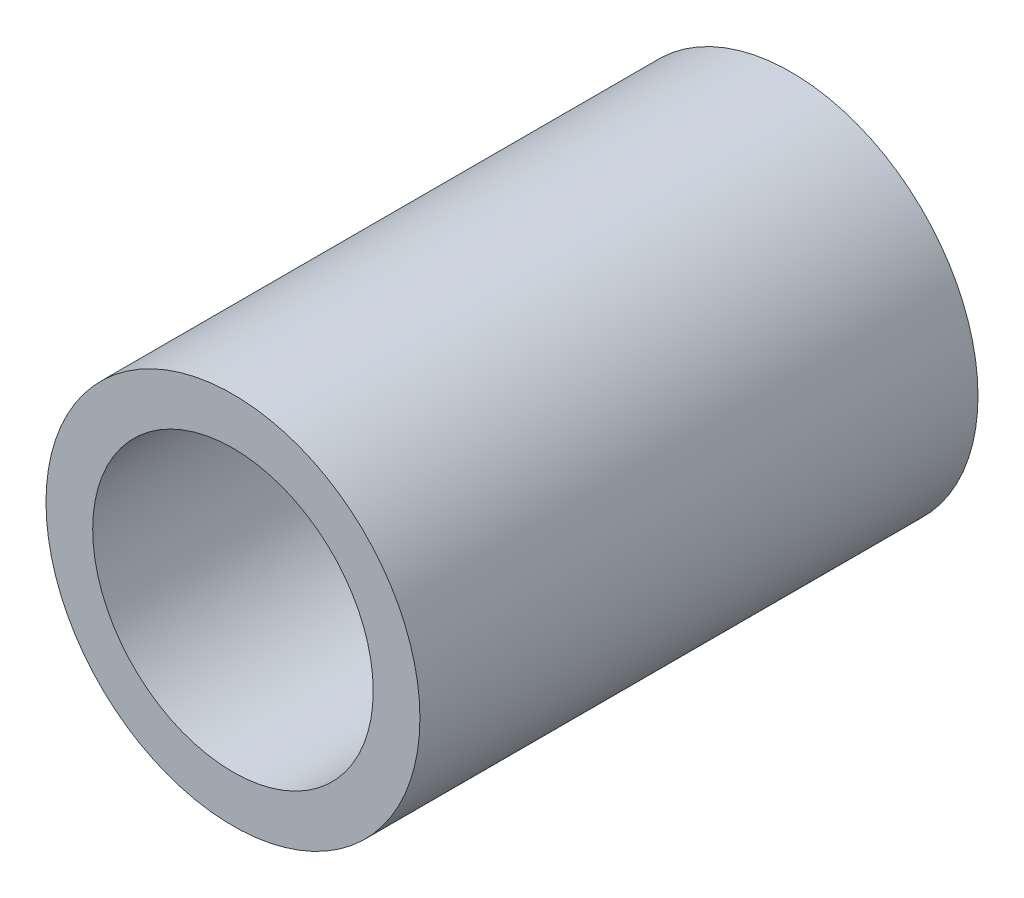
ISO-10303-21;
HEADER;
FILE_DESCRIPTION(('STEP AP214'),'2;1');
FILE_NAME('part.step','',(''),(''),'','','');
FILE_SCHEMA(('AUTOMOTIVE_DESIGN { 1 0 10303 214 1 1 1 1 }'));
ENDSEC;
DATA;
#1=APPLICATION_CONTEXT('core data for automotive mechanical design processes');
#2=APPLICATION_PROTOCOL_DEFINITION('international standard','automotive_design',2000,#1);
#3=PRODUCT_CONTEXT('',#1,'mechanical');
#4=PRODUCT('Part','Part','',(#3));
#5=PRODUCT_RELATED_PRODUCT_CATEGORY('part','',(#4));
#6=PRODUCT_DEFINITION_FORMATION('','',#4);
#7=PRODUCT_DEFINITION_CONTEXT('part definition',#1,'design');
#8=PRODUCT_DEFINITION('design','',#6,#7);
#9=PRODUCT_DEFINITION_SHAPE('','',#8);
#10=(LENGTH_UNIT() NAMED_UNIT(*) SI_UNIT(.MILLI.,.METRE.));
#11=(NAMED_UNIT(*) PLANE_ANGLE_UNIT() SI_UNIT($,.RADIAN.));
#12=(NAMED_UNIT(*) SI_UNIT($,.STERADIAN.) SOLID_ANGLE_UNIT());
#13=UNCERTAINTY_MEASURE_WITH_UNIT(LENGTH_MEASURE(1.E-05),#10,'distance_accuracy_value','');
#14=(GEOMETRIC_REPRESENTATION_CONTEXT(3) GLOBAL_UNCERTAINTY_ASSIGNED_CONTEXT((#13)) GLOBAL_UNIT_ASSIGNED_CONTEXT((#10,
#11,#12)) REPRESENTATION_CONTEXT('',''));
#15=CARTESIAN_POINT('',(0.,0.,0.));
#16=DIRECTION('',(0.,0.,1.));
#17=DIRECTION('',(1.,0.,0.));
#18=AXIS2_PLACEMENT_3D('',#15,#16,#17);
#19=CARTESIAN_POINT('',(0.,0.,-9.525));
#20=DIRECTION('',(0.,0.,1.));
#21=DIRECTION('',(1.,0.,0.));
#22=AXIS2_PLACEMENT_3D('',#19,#20,#21);
#23=CYLINDRICAL_SURFACE('',#22,4.7879);
#24=CARTESIAN_POINT('',(0.,0.,9.525));
#25=DIRECTION('',(0.,0.,1.));
#26=DIRECTION('',(1.,0.,0.));
#27=AXIS2_PLACEMENT_3D('',#24,#25,#26);
#28=CIRCLE('',#27,4.7879);
#29=CARTESIAN_POINT('',(4.7879,0.,9.525));
#30=VERTEX_POINT('',#29);
#31=EDGE_CURVE('E18',#30,#30,#28,.F.);
#32=ORIENTED_EDGE('',*,*,#31,.F.);
#33=EDGE_LOOP('',(#32));
#34=FACE_BOUND('',#33,.T.);
#35=CARTESIAN_POINT('',(0.,0.,-9.525));
#36=DIRECTION('',(0.,0.,1.));
#37=DIRECTION('',(1.,0.,0.));
#38=AXIS2_PLACEMENT_3D('',#35,#36,#37);
#39=CIRCLE('',#38,4.7879);
#40=CARTESIAN_POINT('',(4.7879,0.,-9.525));
#41=VERTEX_POINT('',#40);
#42=EDGE_CURVE('E27',#41,#41,#39,.T.);
#43=ORIENTED_EDGE('',*,*,#42,.F.);
#44=EDGE_LOOP('',(#43));
#45=FACE_BOUND('',#44,.T.);
#46=ADVANCED_FACE('F15',(#34,#45),#23,.F.);
#47=CARTESIAN_POINT('',(0.,6.38175,9.525));
#48=DIRECTION('',(0.,0.,1.));
#49=DIRECTION('',(1.,0.,0.));
#50=AXIS2_PLACEMENT_3D('',#47,#48,#49);
#51=PLANE('',#50);
#52=CARTESIAN_POINT('',(0.,0.,9.525));
#53=DIRECTION('',(0.,0.,1.));
#54=DIRECTION('',(1.,0.,0.));
#55=AXIS2_PLACEMENT_3D('',#52,#53,#54);
#56=CIRCLE('',#55,6.38175);
#57=CARTESIAN_POINT('',(6.38175,0.,9.525));
#58=VERTEX_POINT('',#57);
#59=EDGE_CURVE('E22',#58,#58,#56,.F.);
#60=ORIENTED_EDGE('',*,*,#59,.F.);
#61=EDGE_LOOP('',(#60));
#62=FACE_BOUND('',#61,.T.);
#63=ORIENTED_EDGE('',*,*,#31,.T.);
#64=EDGE_LOOP('',(#63));
#65=FACE_BOUND('',#64,.T.);
#66=ADVANCED_FACE('F35',(#62,#65),#51,.T.);
#67=CARTESIAN_POINT('',(0.,4.7879,-9.525));
#68=DIRECTION('',(0.,0.,-1.));
#69=DIRECTION('',(-1.,0.,0.));
#70=AXIS2_PLACEMENT_3D('',#67,#68,#69);
#71=PLANE('',#70);
#72=ORIENTED_EDGE('',*,*,#42,.T.);
#73=EDGE_LOOP('',(#72));
#74=FACE_BOUND('',#73,.T.);
#75=CARTESIAN_POINT('',(0.,0.,-9.525));
#76=DIRECTION('',(0.,0.,1.));
#77=DIRECTION('',(1.,0.,0.));
#78=AXIS2_PLACEMENT_3D('',#75,#76,#77);
#79=CIRCLE('',#78,6.38175);
#80=CARTESIAN_POINT('',(6.38175,0.,-9.525));
#81=VERTEX_POINT('',#80);
#82=EDGE_CURVE('E10',#81,#81,#79,.T.);
#83=ORIENTED_EDGE('',*,*,#82,.F.);
#84=EDGE_LOOP('',(#83));
#85=FACE_BOUND('',#84,.T.);
#86=ADVANCED_FACE('F43',(#74,#85),#71,.T.);
#87=CARTESIAN_POINT('',(0.,0.,-9.525));
#88=DIRECTION('',(0.,0.,1.));
#89=DIRECTION('',(1.,0.,0.));
#90=AXIS2_PLACEMENT_3D('',#87,#88,#89);
#91=CYLINDRICAL_SURFACE('',#90,6.38175);
#92=ORIENTED_EDGE('',*,*,#82,.T.);
#93=EDGE_LOOP('',(#92));
#94=FACE_BOUND('',#93,.T.);
#95=ORIENTED_EDGE('',*,*,#59,.T.);
#96=EDGE_LOOP('',(#95));
#97=FACE_BOUND('',#96,.T.);
#98=ADVANCED_FACE('F45',(#94,#97),#91,.T.);
#99=CLOSED_SHELL('',(#46,#66,#86,#98));
#100=MANIFOLD_SOLID_BREP('B1',#99);
#101=ADVANCED_BREP_SHAPE_REPRESENTATION('',(#18,#100),#14);
#102=SHAPE_DEFINITION_REPRESENTATION(#9,#101);
ENDSEC;
END-ISO-10303-21;
